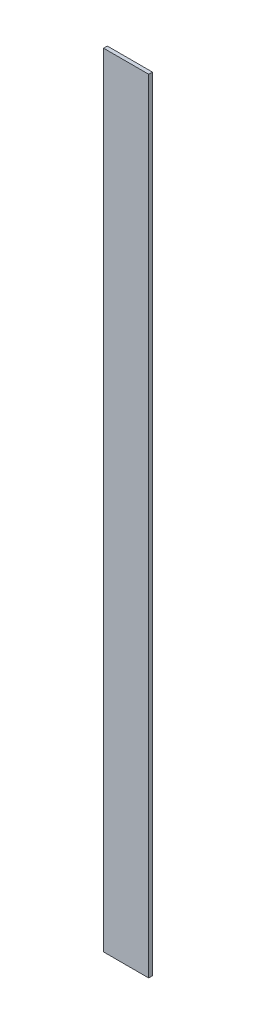
ISO-10303-21;
HEADER;
FILE_DESCRIPTION(('STEP AP214'),'2;1');
FILE_NAME('part.step','',(''),(''),'','','');
FILE_SCHEMA(('AUTOMOTIVE_DESIGN { 1 0 10303 214 1 1 1 1 }'));
ENDSEC;
DATA;
#1=APPLICATION_CONTEXT('core data for automotive mechanical design processes');
#2=APPLICATION_PROTOCOL_DEFINITION('international standard','automotive_design',2000,#1);
#3=PRODUCT_CONTEXT('',#1,'mechanical');
#4=PRODUCT('Part','Part','',(#3));
#5=PRODUCT_RELATED_PRODUCT_CATEGORY('part','',(#4));
#6=PRODUCT_DEFINITION_FORMATION('','',#4);
#7=PRODUCT_DEFINITION_CONTEXT('part definition',#1,'design');
#8=PRODUCT_DEFINITION('design','',#6,#7);
#9=PRODUCT_DEFINITION_SHAPE('','',#8);
#10=(LENGTH_UNIT() NAMED_UNIT(*) SI_UNIT(.MILLI.,.METRE.));
#11=(NAMED_UNIT(*) PLANE_ANGLE_UNIT() SI_UNIT($,.RADIAN.));
#12=(NAMED_UNIT(*) SI_UNIT($,.STERADIAN.) SOLID_ANGLE_UNIT());
#13=UNCERTAINTY_MEASURE_WITH_UNIT(LENGTH_MEASURE(1.E-05),#10,'distance_accuracy_value','');
#14=(GEOMETRIC_REPRESENTATION_CONTEXT(3) GLOBAL_UNCERTAINTY_ASSIGNED_CONTEXT((#13)) GLOBAL_UNIT_ASSIGNED_CONTEXT((#10,
#11,#12)) REPRESENTATION_CONTEXT('',''));
#15=CARTESIAN_POINT('',(0.,0.,0.));
#16=DIRECTION('',(0.,0.,1.));
#17=DIRECTION('',(1.,0.,0.));
#18=AXIS2_PLACEMENT_3D('',#15,#16,#17);
#19=CARTESIAN_POINT('',(0.,660.4,0.));
#20=DIRECTION('',(1.,0.,0.));
#21=DIRECTION('',(0.,0.,-1.));
#22=AXIS2_PLACEMENT_3D('',#19,#20,#21);
#23=PLANE('',#22);
#24=DIRECTION('',(0.,0.,1.));
#25=VECTOR('',#24,1.);
#26=CARTESIAN_POINT('',(0.,0.,0.));
#27=LINE('',#26,#25);
#28=CARTESIAN_POINT('',(0.,0.,-3.175));
#29=VERTEX_POINT('',#28);
#30=CARTESIAN_POINT('',(0.,0.,0.));
#31=VERTEX_POINT('',#30);
#32=EDGE_CURVE('E113',#29,#31,#27,.T.);
#33=ORIENTED_EDGE('',*,*,#32,.T.);
#34=DIRECTION('',(0.,-1.,0.));
#35=VECTOR('',#34,1.);
#36=CARTESIAN_POINT('',(0.,660.4,0.));
#37=LINE('',#36,#35);
#38=CARTESIAN_POINT('',(0.,660.4,0.));
#39=VERTEX_POINT('',#38);
#40=EDGE_CURVE('E11',#39,#31,#37,.T.);
#41=ORIENTED_EDGE('',*,*,#40,.F.);
#42=DIRECTION('',(0.,0.,1.));
#43=VECTOR('',#42,1.);
#44=CARTESIAN_POINT('',(0.,660.4,0.));
#45=LINE('',#44,#43);
#46=CARTESIAN_POINT('',(0.,660.4,-3.175));
#47=VERTEX_POINT('',#46);
#48=EDGE_CURVE('E97',#47,#39,#45,.T.);
#49=ORIENTED_EDGE('',*,*,#48,.F.);
#50=DIRECTION('',(0.,-1.,0.));
#51=VECTOR('',#50,1.);
#52=CARTESIAN_POINT('',(0.,660.4,-3.175));
#53=LINE('',#52,#51);
#54=EDGE_CURVE('E109',#47,#29,#53,.T.);
#55=ORIENTED_EDGE('',*,*,#54,.T.);
#56=EDGE_LOOP('',(#33,#41,#49,#55));
#57=FACE_BOUND('',#56,.T.);
#58=ADVANCED_FACE('F45',(#57),#23,.F.);
#59=CARTESIAN_POINT('',(0.,660.4,0.));
#60=DIRECTION('',(0.,0.,-1.));
#61=DIRECTION('',(-1.,0.,0.));
#62=AXIS2_PLACEMENT_3D('',#59,#60,#61);
#63=PLANE('',#62);
#64=DIRECTION('',(1.,0.,0.));
#65=VECTOR('',#64,1.);
#66=CARTESIAN_POINT('',(0.,0.,0.));
#67=LINE('',#66,#65);
#68=CARTESIAN_POINT('',(38.1,0.,0.));
#69=VERTEX_POINT('',#68);
#70=EDGE_CURVE('E102',#31,#69,#67,.T.);
#71=ORIENTED_EDGE('',*,*,#70,.T.);
#72=DIRECTION('',(0.,-1.,0.));
#73=VECTOR('',#72,1.);
#74=CARTESIAN_POINT('',(38.1,660.4,0.));
#75=LINE('',#74,#73);
#76=CARTESIAN_POINT('',(38.1,660.4,0.));
#77=VERTEX_POINT('',#76);
#78=EDGE_CURVE('E54',#77,#69,#75,.T.);
#79=ORIENTED_EDGE('',*,*,#78,.F.);
#80=DIRECTION('',(1.,0.,0.));
#81=VECTOR('',#80,1.);
#82=CARTESIAN_POINT('',(0.,660.4,0.));
#83=LINE('',#82,#81);
#84=EDGE_CURVE('E92',#39,#77,#83,.T.);
#85=ORIENTED_EDGE('',*,*,#84,.F.);
#86=ORIENTED_EDGE('',*,*,#40,.T.);
#87=EDGE_LOOP('',(#71,#79,#85,#86));
#88=FACE_BOUND('',#87,.T.);
#89=ADVANCED_FACE('F101',(#88),#63,.F.);
#90=CARTESIAN_POINT('',(38.1,660.4,0.));
#91=DIRECTION('',(-1.,0.,0.));
#92=DIRECTION('',(0.,0.,1.));
#93=AXIS2_PLACEMENT_3D('',#90,#91,#92);
#94=PLANE('',#93);
#95=DIRECTION('',(0.,0.,-1.));
#96=VECTOR('',#95,1.);
#97=CARTESIAN_POINT('',(38.1,0.,0.));
#98=LINE('',#97,#96);
#99=CARTESIAN_POINT('',(38.1,0.,-3.175));
#100=VERTEX_POINT('',#99);
#101=EDGE_CURVE('E79',#69,#100,#98,.T.);
#102=ORIENTED_EDGE('',*,*,#101,.T.);
#103=DIRECTION('',(0.,-1.,0.));
#104=VECTOR('',#103,1.);
#105=CARTESIAN_POINT('',(38.1,660.4,-3.175));
#106=LINE('',#105,#104);
#107=CARTESIAN_POINT('',(38.1,660.4,-3.175));
#108=VERTEX_POINT('',#107);
#109=EDGE_CURVE('E104',#108,#100,#106,.T.);
#110=ORIENTED_EDGE('',*,*,#109,.F.);
#111=DIRECTION('',(0.,0.,-1.));
#112=VECTOR('',#111,1.);
#113=CARTESIAN_POINT('',(38.1,660.4,0.));
#114=LINE('',#113,#112);
#115=EDGE_CURVE('E95',#77,#108,#114,.T.);
#116=ORIENTED_EDGE('',*,*,#115,.F.);
#117=ORIENTED_EDGE('',*,*,#78,.T.);
#118=EDGE_LOOP('',(#102,#110,#116,#117));
#119=FACE_BOUND('',#118,.T.);
#120=ADVANCED_FACE('F105',(#119),#94,.F.);
#121=CARTESIAN_POINT('',(0.,660.4,-3.175));
#122=DIRECTION('',(0.,0.,1.));
#123=DIRECTION('',(1.,0.,0.));
#124=AXIS2_PLACEMENT_3D('',#121,#122,#123);
#125=PLANE('',#124);
#126=DIRECTION('',(-1.,0.,0.));
#127=VECTOR('',#126,1.);
#128=CARTESIAN_POINT('',(0.,0.,-3.175));
#129=LINE('',#128,#127);
#130=EDGE_CURVE('E85',#100,#29,#129,.T.);
#131=ORIENTED_EDGE('',*,*,#130,.T.);
#132=ORIENTED_EDGE('',*,*,#54,.F.);
#133=DIRECTION('',(-1.,0.,0.));
#134=VECTOR('',#133,1.);
#135=CARTESIAN_POINT('',(0.,660.4,-3.175));
#136=LINE('',#135,#134);
#137=EDGE_CURVE('E62',#108,#47,#136,.T.);
#138=ORIENTED_EDGE('',*,*,#137,.F.);
#139=ORIENTED_EDGE('',*,*,#109,.T.);
#140=EDGE_LOOP('',(#131,#132,#138,#139));
#141=FACE_BOUND('',#140,.T.);
#142=ADVANCED_FACE('F126',(#141),#125,.F.);
#143=CARTESIAN_POINT('',(0.,660.4,0.));
#144=DIRECTION('',(0.,-1.,0.));
#145=DIRECTION('',(0.,0.,-1.));
#146=AXIS2_PLACEMENT_3D('',#143,#144,#145);
#147=PLANE('',#146);
#148=ORIENTED_EDGE('',*,*,#48,.T.);
#149=ORIENTED_EDGE('',*,*,#84,.T.);
#150=ORIENTED_EDGE('',*,*,#115,.T.);
#151=ORIENTED_EDGE('',*,*,#137,.T.);
#152=EDGE_LOOP('',(#148,#149,#150,#151));
#153=FACE_BOUND('',#152,.T.);
#154=ADVANCED_FACE('F93',(#153),#147,.F.);
#155=CARTESIAN_POINT('',(0.,0.,0.));
#156=DIRECTION('',(0.,-1.,0.));
#157=DIRECTION('',(0.,0.,-1.));
#158=AXIS2_PLACEMENT_3D('',#155,#156,#157);
#159=PLANE('',#158);
#160=ORIENTED_EDGE('',*,*,#32,.F.);
#161=ORIENTED_EDGE('',*,*,#130,.F.);
#162=ORIENTED_EDGE('',*,*,#101,.F.);
#163=ORIENTED_EDGE('',*,*,#70,.F.);
#164=EDGE_LOOP('',(#160,#161,#162,#163));
#165=FACE_BOUND('',#164,.T.);
#166=ADVANCED_FACE('F129',(#165),#159,.T.);
#167=CLOSED_SHELL('',(#58,#89,#120,#142,#154,#166));
#168=MANIFOLD_SOLID_BREP('B2',#167);
#169=ADVANCED_BREP_SHAPE_REPRESENTATION('',(#18,#168),#14);
#170=SHAPE_DEFINITION_REPRESENTATION(#9,#169);
ENDSEC;
END-ISO-10303-21;
